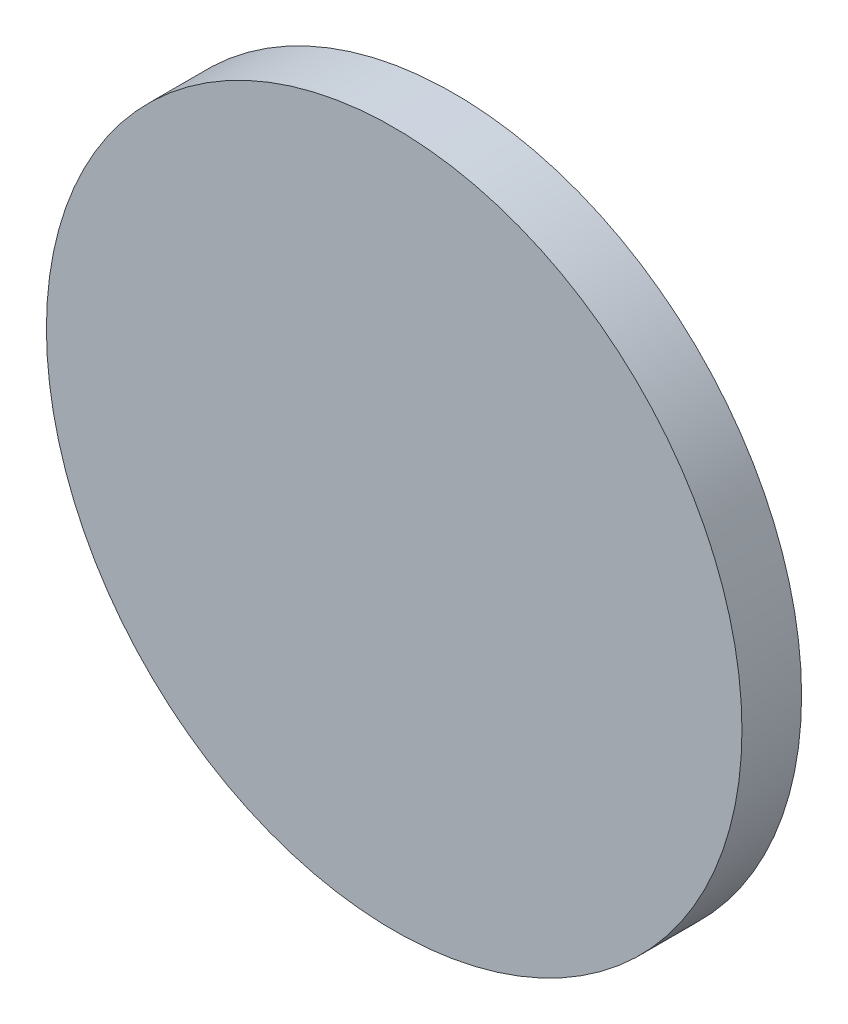
ISO-10303-21;
HEADER;
FILE_DESCRIPTION(('STEP AP214'),'2;1');
FILE_NAME('part.step','',(''),(''),'','','');
FILE_SCHEMA(('AUTOMOTIVE_DESIGN { 1 0 10303 214 1 1 1 1 }'));
ENDSEC;
DATA;
#1=APPLICATION_CONTEXT('core data for automotive mechanical design processes');
#2=APPLICATION_PROTOCOL_DEFINITION('international standard','automotive_design',2000,#1);
#3=PRODUCT_CONTEXT('',#1,'mechanical');
#4=PRODUCT('Part','Part','',(#3));
#5=PRODUCT_RELATED_PRODUCT_CATEGORY('part','',(#4));
#6=PRODUCT_DEFINITION_FORMATION('','',#4);
#7=PRODUCT_DEFINITION_CONTEXT('part definition',#1,'design');
#8=PRODUCT_DEFINITION('design','',#6,#7);
#9=PRODUCT_DEFINITION_SHAPE('','',#8);
#10=(LENGTH_UNIT() NAMED_UNIT(*) SI_UNIT(.MILLI.,.METRE.));
#11=(NAMED_UNIT(*) PLANE_ANGLE_UNIT() SI_UNIT($,.RADIAN.));
#12=(NAMED_UNIT(*) SI_UNIT($,.STERADIAN.) SOLID_ANGLE_UNIT());
#13=UNCERTAINTY_MEASURE_WITH_UNIT(LENGTH_MEASURE(1.E-05),#10,'distance_accuracy_value','');
#14=(GEOMETRIC_REPRESENTATION_CONTEXT(3) GLOBAL_UNCERTAINTY_ASSIGNED_CONTEXT((#13)) GLOBAL_UNIT_ASSIGNED_CONTEXT((#10,
#11,#12)) REPRESENTATION_CONTEXT('',''));
#15=CARTESIAN_POINT('',(0.,0.,0.));
#16=DIRECTION('',(0.,0.,1.));
#17=DIRECTION('',(1.,0.,0.));
#18=AXIS2_PLACEMENT_3D('',#15,#16,#17);
#19=CARTESIAN_POINT('',(2.70764,3.350260006176,0.03429));
#20=DIRECTION('',(0.,0.,1.));
#21=DIRECTION('',(1.,0.,0.));
#22=AXIS2_PLACEMENT_3D('',#19,#20,#21);
#23=PLANE('',#22);
#24=CARTESIAN_POINT('',(2.70764,3.350260006176,0.03429));
#25=DIRECTION('',(0.,0.,1.));
#26=DIRECTION('',(1.,0.,0.));
#27=AXIS2_PLACEMENT_3D('',#24,#25,#26);
#28=CIRCLE('',#27,0.200024667);
#29=CARTESIAN_POINT('',(2.907664667,3.350260006176,0.03429));
#30=VERTEX_POINT('',#29);
#31=EDGE_CURVE('E18',#30,#30,#28,.F.);
#32=ORIENTED_EDGE('',*,*,#31,.F.);
#33=EDGE_LOOP('',(#32));
#34=FACE_BOUND('',#33,.T.);
#35=ADVANCED_FACE('F15',(#34),#23,.T.);
#36=CARTESIAN_POINT('',(2.70764,3.350260006176,0.));
#37=DIRECTION('',(0.,0.,1.));
#38=DIRECTION('',(1.,0.,0.));
#39=AXIS2_PLACEMENT_3D('',#36,#37,#38);
#40=CYLINDRICAL_SURFACE('',#39,0.200024667);
#41=ORIENTED_EDGE('',*,*,#31,.T.);
#42=EDGE_LOOP('',(#41));
#43=FACE_BOUND('',#42,.T.);
#44=CARTESIAN_POINT('',(2.70764,3.350260006176,0.));
#45=DIRECTION('',(0.,0.,1.));
#46=DIRECTION('',(1.,0.,0.));
#47=AXIS2_PLACEMENT_3D('',#44,#45,#46);
#48=CIRCLE('',#47,0.200024667);
#49=CARTESIAN_POINT('',(2.907664667,3.350260006176,0.));
#50=VERTEX_POINT('',#49);
#51=EDGE_CURVE('E10',#50,#50,#48,.F.);
#52=ORIENTED_EDGE('',*,*,#51,.F.);
#53=EDGE_LOOP('',(#52));
#54=FACE_BOUND('',#53,.T.);
#55=ADVANCED_FACE('F27',(#43,#54),#40,.T.);
#56=CARTESIAN_POINT('',(2.70764,3.350260006176,0.));
#57=DIRECTION('',(0.,0.,-1.));
#58=DIRECTION('',(-1.,0.,0.));
#59=AXIS2_PLACEMENT_3D('',#56,#57,#58);
#60=PLANE('',#59);
#61=ORIENTED_EDGE('',*,*,#51,.T.);
#62=EDGE_LOOP('',(#61));
#63=FACE_BOUND('',#62,.T.);
#64=ADVANCED_FACE('F35',(#63),#60,.T.);
#65=CLOSED_SHELL('',(#35,#55,#64));
#66=MANIFOLD_SOLID_BREP('B1',#65);
#67=ADVANCED_BREP_SHAPE_REPRESENTATION('',(#18,#66),#14);
#68=SHAPE_DEFINITION_REPRESENTATION(#9,#67);
ENDSEC;
END-ISO-10303-21;
